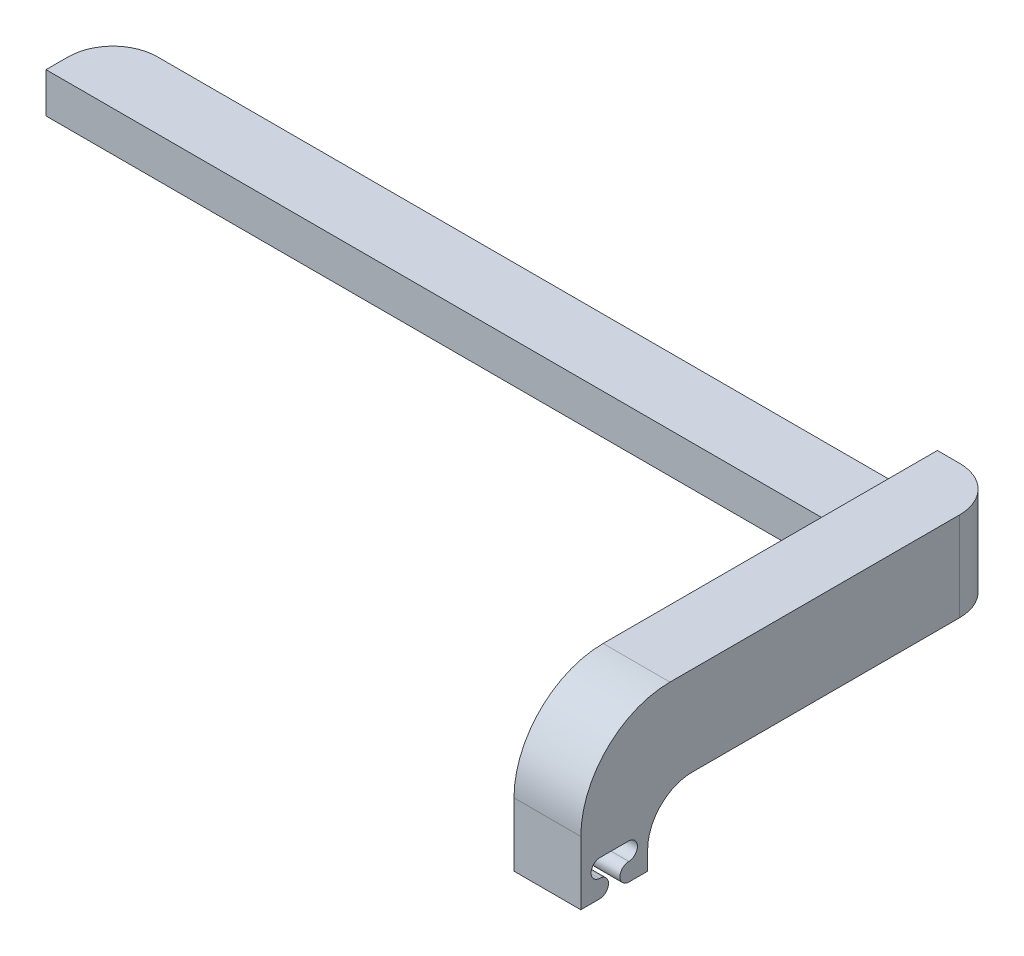
ISO-10303-21;
HEADER;
FILE_DESCRIPTION(('STEP AP214'),'2;1');
FILE_NAME('part.step','',(''),(''),'','','');
FILE_SCHEMA(('AUTOMOTIVE_DESIGN { 1 0 10303 214 1 1 1 1 }'));
ENDSEC;
DATA;
#1=APPLICATION_CONTEXT('core data for automotive mechanical design processes');
#2=APPLICATION_PROTOCOL_DEFINITION('international standard','automotive_design',2000,#1);
#3=PRODUCT_CONTEXT('',#1,'mechanical');
#4=PRODUCT('Part','Part','',(#3));
#5=PRODUCT_RELATED_PRODUCT_CATEGORY('part','',(#4));
#6=PRODUCT_DEFINITION_FORMATION('','',#4);
#7=PRODUCT_DEFINITION_CONTEXT('part definition',#1,'design');
#8=PRODUCT_DEFINITION('design','',#6,#7);
#9=PRODUCT_DEFINITION_SHAPE('','',#8);
#10=(LENGTH_UNIT() NAMED_UNIT(*) SI_UNIT(.MILLI.,.METRE.));
#11=(NAMED_UNIT(*) PLANE_ANGLE_UNIT() SI_UNIT($,.RADIAN.));
#12=(NAMED_UNIT(*) SI_UNIT($,.STERADIAN.) SOLID_ANGLE_UNIT());
#13=UNCERTAINTY_MEASURE_WITH_UNIT(LENGTH_MEASURE(1.E-05),#10,'distance_accuracy_value','');
#14=(GEOMETRIC_REPRESENTATION_CONTEXT(3) GLOBAL_UNCERTAINTY_ASSIGNED_CONTEXT((#13)) GLOBAL_UNIT_ASSIGNED_CONTEXT((#10,
#11,#12)) REPRESENTATION_CONTEXT('',''));
#15=CARTESIAN_POINT('',(0.,0.,0.));
#16=DIRECTION('',(0.,0.,1.));
#17=DIRECTION('',(1.,0.,0.));
#18=AXIS2_PLACEMENT_3D('',#15,#16,#17);
#19=CARTESIAN_POINT('',(-43.083100559231,-15.6274777520744,-31.25));
#20=DIRECTION('',(0.,1.,0.));
#21=DIRECTION('',(0.,0.,1.));
#22=AXIS2_PLACEMENT_3D('',#19,#20,#21);
#23=CYLINDRICAL_SURFACE('',#22,5.);
#24=CARTESIAN_POINT('',(-43.083100559231,-25.6274777520744,-31.25));
#25=DIRECTION('',(0.,-1.,0.));
#26=DIRECTION('',(0.,0.,-1.));
#27=AXIS2_PLACEMENT_3D('',#24,#25,#26);
#28=CIRCLE('',#27,5.);
#29=CARTESIAN_POINT('',(-48.083100559231,-25.6274777520744,-31.25));
#30=VERTEX_POINT('',#29);
#31=CARTESIAN_POINT('',(-43.083100559231,-25.6274777520744,-36.25));
#32=VERTEX_POINT('',#31);
#33=EDGE_CURVE('E347',#30,#32,#28,.T.);
#34=ORIENTED_EDGE('',*,*,#33,.F.);
#35=DIRECTION('',(0.,1.,0.));
#36=VECTOR('',#35,1.);
#37=CARTESIAN_POINT('',(-48.083100559231,-21.1274777520744,-31.25));
#38=LINE('',#37,#36);
#39=CARTESIAN_POINT('',(-48.083100559231,-21.1274777520744,-31.25));
#40=VERTEX_POINT('',#39);
#41=EDGE_CURVE('E338',#40,#30,#38,.F.);
#42=ORIENTED_EDGE('',*,*,#41,.F.);
#43=CARTESIAN_POINT('',(-43.083100559231,-21.1274777520744,-31.25));
#44=DIRECTION('',(0.,1.,0.));
#45=DIRECTION('',(0.,0.,1.));
#46=AXIS2_PLACEMENT_3D('',#43,#44,#45);
#47=CIRCLE('',#46,5.);
#48=CARTESIAN_POINT('',(-43.083100559231,-21.1274777520744,-36.25));
#49=VERTEX_POINT('',#48);
#50=EDGE_CURVE('E335',#49,#40,#47,.T.);
#51=ORIENTED_EDGE('',*,*,#50,.F.);
#52=DIRECTION('',(0.,1.,0.));
#53=VECTOR('',#52,1.);
#54=CARTESIAN_POINT('',(-43.083100559231,-15.6274777520744,-36.25));
#55=LINE('',#54,#53);
#56=EDGE_CURVE('E331',#32,#49,#55,.T.);
#57=ORIENTED_EDGE('',*,*,#56,.F.);
#58=EDGE_LOOP('',(#34,#42,#51,#57));
#59=FACE_BOUND('',#58,.T.);
#60=ADVANCED_FACE('F43',(#59),#23,.T.);
#61=CARTESIAN_POINT('',(-48.083100559231,-21.1274777520744,-28.75));
#62=DIRECTION('',(-1.,0.,0.));
#63=DIRECTION('',(0.,0.,1.));
#64=AXIS2_PLACEMENT_3D('',#61,#62,#63);
#65=PLANE('',#64);
#66=DIRECTION('',(0.,0.,-1.));
#67=VECTOR('',#66,1.);
#68=CARTESIAN_POINT('',(-48.083100559231,-21.1274777520744,-28.75));
#69=LINE('',#68,#67);
#70=CARTESIAN_POINT('',(-48.083100559231,-21.1274777520744,-28.75));
#71=VERTEX_POINT('',#70);
#72=EDGE_CURVE('E271',#71,#40,#69,.T.);
#73=ORIENTED_EDGE('',*,*,#72,.T.);
#74=ORIENTED_EDGE('',*,*,#41,.T.);
#75=DIRECTION('',(0.,0.,-1.));
#76=VECTOR('',#75,1.);
#77=CARTESIAN_POINT('',(-48.083100559231,-25.6274777520744,-28.75));
#78=LINE('',#77,#76);
#79=CARTESIAN_POINT('',(-48.083100559231,-25.6274777520744,-28.75));
#80=VERTEX_POINT('',#79);
#81=EDGE_CURVE('E263',#80,#30,#78,.T.);
#82=ORIENTED_EDGE('',*,*,#81,.F.);
#83=DIRECTION('',(0.,1.,0.));
#84=VECTOR('',#83,1.);
#85=CARTESIAN_POINT('',(-48.083100559231,-21.1274777520744,-28.75));
#86=LINE('',#85,#84);
#87=EDGE_CURVE('E255',#80,#71,#86,.T.);
#88=ORIENTED_EDGE('',*,*,#87,.T.);
#89=EDGE_LOOP('',(#73,#74,#82,#88));
#90=FACE_BOUND('',#89,.T.);
#91=ADVANCED_FACE('F411',(#90),#65,.T.);
#92=CARTESIAN_POINT('',(0.,0.,-28.75));
#93=DIRECTION('',(0.,0.,-1.));
#94=DIRECTION('',(0.,1.,0.));
#95=AXIS2_PLACEMENT_3D('',#92,#93,#94);
#96=PLANE('',#95);
#97=DIRECTION('',(0.,-1.,0.));
#98=VECTOR('',#97,1.);
#99=CARTESIAN_POINT('',(44.416899440769,-21.1274777520744,-28.75));
#100=LINE('',#99,#98);
#101=CARTESIAN_POINT('',(44.416899440769,-21.1274777520744,-28.75));
#102=VERTEX_POINT('',#101);
#103=CARTESIAN_POINT('',(44.416899440769,-25.6274777520744,-28.75));
#104=VERTEX_POINT('',#103);
#105=EDGE_CURVE('E247',#102,#104,#100,.T.);
#106=ORIENTED_EDGE('',*,*,#105,.F.);
#107=DIRECTION('',(1.,0.,0.));
#108=VECTOR('',#107,1.);
#109=CARTESIAN_POINT('',(44.416899440769,-21.1274777520744,-28.75));
#110=LINE('',#109,#108);
#111=EDGE_CURVE('E259',#71,#102,#110,.T.);
#112=ORIENTED_EDGE('',*,*,#111,.F.);
#113=ORIENTED_EDGE('',*,*,#87,.F.);
#114=DIRECTION('',(-1.,0.,0.));
#115=VECTOR('',#114,1.);
#116=CARTESIAN_POINT('',(44.416899440769,-25.6274777520744,-28.75));
#117=LINE('',#116,#115);
#118=EDGE_CURVE('E251',#104,#80,#117,.T.);
#119=ORIENTED_EDGE('',*,*,#118,.F.);
#120=EDGE_LOOP('',(#106,#112,#113,#119));
#121=FACE_BOUND('',#120,.T.);
#122=ADVANCED_FACE('F417',(#121),#96,.F.);
#123=CARTESIAN_POINT('',(44.416899440769,-21.1274777520744,-28.75));
#124=DIRECTION('',(0.,1.,0.));
#125=DIRECTION('',(0.,0.,1.));
#126=AXIS2_PLACEMENT_3D('',#123,#124,#125);
#127=PLANE('',#126);
#128=DIRECTION('',(1.,0.,0.));
#129=VECTOR('',#128,1.);
#130=CARTESIAN_POINT('',(44.416899440769,-21.1274777520744,-36.25));
#131=LINE('',#130,#129);
#132=CARTESIAN_POINT('',(44.416899440769,-21.1274777520744,-36.25));
#133=VERTEX_POINT('',#132);
#134=EDGE_CURVE('E246',#49,#133,#131,.T.);
#135=ORIENTED_EDGE('',*,*,#134,.F.);
#136=ORIENTED_EDGE('',*,*,#50,.T.);
#137=ORIENTED_EDGE('',*,*,#72,.F.);
#138=ORIENTED_EDGE('',*,*,#111,.T.);
#139=DIRECTION('',(0.,0.,-1.));
#140=VECTOR('',#139,1.);
#141=CARTESIAN_POINT('',(44.416899440769,-21.1274777520744,-28.75));
#142=LINE('',#141,#140);
#143=EDGE_CURVE('E266',#102,#133,#142,.T.);
#144=ORIENTED_EDGE('',*,*,#143,.T.);
#145=EDGE_LOOP('',(#135,#136,#137,#138,#144));
#146=FACE_BOUND('',#145,.T.);
#147=ADVANCED_FACE('F461',(#146),#127,.T.);
#148=CARTESIAN_POINT('',(44.416899440769,-15.6274777520744,-36.25));
#149=DIRECTION('',(0.,0.,-1.));
#150=DIRECTION('',(0.,1.,0.));
#151=AXIS2_PLACEMENT_3D('',#148,#149,#150);
#152=PLANE('',#151);
#153=DIRECTION('',(1.,0.,0.));
#154=VECTOR('',#153,1.);
#155=CARTESIAN_POINT('',(44.416899440769,-25.6274777520744,-36.25));
#156=LINE('',#155,#154);
#157=CARTESIAN_POINT('',(46.916899440769,-25.6274777520744,-36.25));
#158=VERTEX_POINT('',#157);
#159=EDGE_CURVE('E285',#32,#158,#156,.T.);
#160=ORIENTED_EDGE('',*,*,#159,.F.);
#161=ORIENTED_EDGE('',*,*,#56,.T.);
#162=ORIENTED_EDGE('',*,*,#134,.T.);
#163=DIRECTION('',(0.,1.,0.));
#164=VECTOR('',#163,1.);
#165=CARTESIAN_POINT('',(44.416899440769,-15.6274777520744,-36.25));
#166=LINE('',#165,#164);
#167=CARTESIAN_POINT('',(44.416899440769,-15.6274777520744,-36.25));
#168=VERTEX_POINT('',#167);
#169=EDGE_CURVE('E281',#133,#168,#166,.T.);
#170=ORIENTED_EDGE('',*,*,#169,.T.);
#171=DIRECTION('',(1.,0.,0.));
#172=VECTOR('',#171,1.);
#173=CARTESIAN_POINT('',(44.416899440769,-15.6274777520744,-36.25));
#174=LINE('',#173,#172);
#175=CARTESIAN_POINT('',(46.916899440769,-15.6274777520744,-36.25));
#176=VERTEX_POINT('',#175);
#177=EDGE_CURVE('E289',#168,#176,#174,.T.);
#178=ORIENTED_EDGE('',*,*,#177,.T.);
#179=DIRECTION('',(0.,1.,0.));
#180=VECTOR('',#179,1.);
#181=CARTESIAN_POINT('',(46.916899440769,-25.6274777520744,-36.25));
#182=LINE('',#181,#180);
#183=EDGE_CURVE('E328',#176,#158,#182,.F.);
#184=ORIENTED_EDGE('',*,*,#183,.T.);
#185=EDGE_LOOP('',(#160,#161,#162,#170,#178,#184));
#186=FACE_BOUND('',#185,.T.);
#187=ADVANCED_FACE('F435',(#186),#152,.T.);
#188=CARTESIAN_POINT('',(0.,-15.6274777520744,11.25));
#189=DIRECTION('',(0.,-1.,0.));
#190=DIRECTION('',(1.,0.,0.));
#191=AXIS2_PLACEMENT_3D('',#188,#189,#190);
#192=PLANE('',#191);
#193=DIRECTION('',(0.,0.,-1.));
#194=VECTOR('',#193,1.);
#195=CARTESIAN_POINT('',(51.916899440769,-15.6274777520745,11.25));
#196=LINE('',#195,#194);
#197=CARTESIAN_POINT('',(51.916899440769,-15.6274777520745,1.25));
#198=VERTEX_POINT('',#197);
#199=CARTESIAN_POINT('',(51.916899440769,-15.6274777520745,-31.25));
#200=VERTEX_POINT('',#199);
#201=EDGE_CURVE('E310',#198,#200,#196,.T.);
#202=ORIENTED_EDGE('',*,*,#201,.T.);
#203=CARTESIAN_POINT('',(46.916899440769,-15.6274777520744,-31.25));
#204=DIRECTION('',(0.,-1.,0.));
#205=DIRECTION('',(1.,0.,0.));
#206=AXIS2_PLACEMENT_3D('',#203,#204,#205);
#207=CIRCLE('',#206,5.);
#208=EDGE_CURVE('E354',#200,#176,#207,.F.);
#209=ORIENTED_EDGE('',*,*,#208,.T.);
#210=ORIENTED_EDGE('',*,*,#177,.F.);
#211=DIRECTION('',(0.,0.,-1.));
#212=VECTOR('',#211,1.);
#213=CARTESIAN_POINT('',(44.416899440769,-15.6274777520744,11.25));
#214=LINE('',#213,#212);
#215=CARTESIAN_POINT('',(44.416899440769,-15.6274777520744,1.25));
#216=VERTEX_POINT('',#215);
#217=EDGE_CURVE('E303',#216,#168,#214,.T.);
#218=ORIENTED_EDGE('',*,*,#217,.F.);
#219=DIRECTION('',(-1.,0.,0.));
#220=VECTOR('',#219,1.);
#221=CARTESIAN_POINT('',(51.916899440769,-15.6274777520745,1.25));
#222=LINE('',#221,#220);
#223=EDGE_CURVE('E321',#216,#198,#222,.F.);
#224=ORIENTED_EDGE('',*,*,#223,.T.);
#225=EDGE_LOOP('',(#202,#209,#210,#218,#224));
#226=FACE_BOUND('',#225,.T.);
#227=ADVANCED_FACE('F427',(#226),#192,.F.);
#228=CARTESIAN_POINT('',(46.916899440769,0.,-31.25));
#229=DIRECTION('',(0.,-1.,0.));
#230=DIRECTION('',(0.,0.,-1.));
#231=AXIS2_PLACEMENT_3D('',#228,#229,#230);
#232=CYLINDRICAL_SURFACE('',#231,5.);
#233=CARTESIAN_POINT('',(46.916899440769,-25.6274777520744,-31.25));
#234=DIRECTION('',(0.,-1.,0.));
#235=DIRECTION('',(0.,0.,-1.));
#236=AXIS2_PLACEMENT_3D('',#233,#234,#235);
#237=CIRCLE('',#236,5.);
#238=CARTESIAN_POINT('',(51.916899440769,-25.6274777520744,-31.25));
#239=VERTEX_POINT('',#238);
#240=EDGE_CURVE('E344',#158,#239,#237,.T.);
#241=ORIENTED_EDGE('',*,*,#240,.F.);
#242=ORIENTED_EDGE('',*,*,#183,.F.);
#243=ORIENTED_EDGE('',*,*,#208,.F.);
#244=DIRECTION('',(0.,1.,0.));
#245=VECTOR('',#244,1.);
#246=CARTESIAN_POINT('',(51.916899440769,-15.6274777520744,-31.25));
#247=LINE('',#246,#245);
#248=EDGE_CURVE('E350',#239,#200,#247,.T.);
#249=ORIENTED_EDGE('',*,*,#248,.F.);
#250=EDGE_LOOP('',(#241,#242,#243,#249));
#251=FACE_BOUND('',#250,.T.);
#252=ADVANCED_FACE('F424',(#251),#232,.T.);
#253=CARTESIAN_POINT('',(44.416899440769,-25.6274777520744,3.75));
#254=DIRECTION('',(0.,-1.,0.));
#255=DIRECTION('',(0.,0.,-1.));
#256=AXIS2_PLACEMENT_3D('',#253,#254,#255);
#257=PLANE('',#256);
#258=ORIENTED_EDGE('',*,*,#81,.T.);
#259=ORIENTED_EDGE('',*,*,#33,.T.);
#260=ORIENTED_EDGE('',*,*,#159,.T.);
#261=ORIENTED_EDGE('',*,*,#240,.T.);
#262=DIRECTION('',(0.,0.,-1.));
#263=VECTOR('',#262,1.);
#264=CARTESIAN_POINT('',(51.916899440769,-25.6274777520744,3.75));
#265=LINE('',#264,#263);
#266=CARTESIAN_POINT('',(51.916899440769,-25.6274777520744,-1.25));
#267=VERTEX_POINT('',#266);
#268=EDGE_CURVE('E270',#267,#239,#265,.T.);
#269=ORIENTED_EDGE('',*,*,#268,.F.);
#270=DIRECTION('',(1.,0.,0.));
#271=VECTOR('',#270,1.);
#272=CARTESIAN_POINT('',(44.416899440769,-25.6274777520744,-1.25));
#273=LINE('',#272,#271);
#274=CARTESIAN_POINT('',(44.416899440769,-25.6274777520744,-1.25));
#275=VERTEX_POINT('',#274);
#276=EDGE_CURVE('E341',#267,#275,#273,.F.);
#277=ORIENTED_EDGE('',*,*,#276,.T.);
#278=DIRECTION('',(0.,0.,-1.));
#279=VECTOR('',#278,1.);
#280=CARTESIAN_POINT('',(44.416899440769,-25.6274777520744,3.75));
#281=LINE('',#280,#279);
#282=EDGE_CURVE('E278',#275,#104,#281,.T.);
#283=ORIENTED_EDGE('',*,*,#282,.T.);
#284=ORIENTED_EDGE('',*,*,#118,.T.);
#285=EDGE_LOOP('',(#258,#259,#260,#261,#269,#277,#283,#284));
#286=FACE_BOUND('',#285,.T.);
#287=ADVANCED_FACE('F426',(#286),#257,.T.);
#288=CARTESIAN_POINT('',(0.,-25.6274777520744,1.25));
#289=DIRECTION('',(1.,0.,0.));
#290=DIRECTION('',(0.,1.,0.));
#291=AXIS2_PLACEMENT_3D('',#288,#289,#290);
#292=CYLINDRICAL_SURFACE('',#291,10.);
#293=CARTESIAN_POINT('',(51.916899440769,-25.6274777520745,1.25));
#294=DIRECTION('',(-1.,0.,0.));
#295=DIRECTION('',(0.,0.,1.));
#296=AXIS2_PLACEMENT_3D('',#293,#294,#295);
#297=CIRCLE('',#296,10.);
#298=CARTESIAN_POINT('',(51.916899440769,-25.6274777520745,11.25));
#299=VERTEX_POINT('',#298);
#300=EDGE_CURVE('E324',#198,#299,#297,.F.);
#301=ORIENTED_EDGE('',*,*,#300,.F.);
#302=ORIENTED_EDGE('',*,*,#223,.F.);
#303=CARTESIAN_POINT('',(44.416899440769,-25.6274777520744,1.25));
#304=DIRECTION('',(-1.,0.,0.));
#305=DIRECTION('',(0.,-1.,0.));
#306=AXIS2_PLACEMENT_3D('',#303,#304,#305);
#307=CIRCLE('',#306,10.);
#308=CARTESIAN_POINT('',(44.416899440769,-25.6274777520744,11.25));
#309=VERTEX_POINT('',#308);
#310=EDGE_CURVE('E318',#309,#216,#307,.T.);
#311=ORIENTED_EDGE('',*,*,#310,.F.);
#312=DIRECTION('',(-1.,0.,0.));
#313=VECTOR('',#312,1.);
#314=CARTESIAN_POINT('',(44.4168994407689,-25.6274777520744,11.25));
#315=LINE('',#314,#313);
#316=EDGE_CURVE('E314',#299,#309,#315,.T.);
#317=ORIENTED_EDGE('',*,*,#316,.F.);
#318=EDGE_LOOP('',(#301,#302,#311,#317));
#319=FACE_BOUND('',#318,.T.);
#320=ADVANCED_FACE('F422',(#319),#292,.T.);
#321=CARTESIAN_POINT('',(0.,-30.6274777520744,-1.25));
#322=DIRECTION('',(1.,0.,0.));
#323=DIRECTION('',(0.,0.,-1.));
#324=AXIS2_PLACEMENT_3D('',#321,#322,#323);
#325=CYLINDRICAL_SURFACE('',#324,5.);
#326=CARTESIAN_POINT('',(44.416899440769,-30.6274777520744,-1.25));
#327=DIRECTION('',(-1.,0.,0.));
#328=DIRECTION('',(0.,-1.,0.));
#329=AXIS2_PLACEMENT_3D('',#326,#327,#328);
#330=CIRCLE('',#329,5.);
#331=CARTESIAN_POINT('',(44.416899440769,-30.6274777520744,3.75));
#332=VERTEX_POINT('',#331);
#333=EDGE_CURVE('E363',#275,#332,#330,.F.);
#334=ORIENTED_EDGE('',*,*,#333,.F.);
#335=ORIENTED_EDGE('',*,*,#276,.F.);
#336=CARTESIAN_POINT('',(51.916899440769,-30.6274777520744,-1.25));
#337=DIRECTION('',(-1.,0.,0.));
#338=DIRECTION('',(0.,0.,1.));
#339=AXIS2_PLACEMENT_3D('',#336,#337,#338);
#340=CIRCLE('',#339,5.);
#341=CARTESIAN_POINT('',(51.916899440769,-30.6274777520744,3.75));
#342=VERTEX_POINT('',#341);
#343=EDGE_CURVE('E360',#342,#267,#340,.T.);
#344=ORIENTED_EDGE('',*,*,#343,.F.);
#345=DIRECTION('',(1.,0.,0.));
#346=VECTOR('',#345,1.);
#347=CARTESIAN_POINT('',(0.,-30.6274777520744,3.75));
#348=LINE('',#347,#346);
#349=EDGE_CURVE('E357',#332,#342,#348,.T.);
#350=ORIENTED_EDGE('',*,*,#349,.F.);
#351=EDGE_LOOP('',(#334,#335,#344,#350));
#352=FACE_BOUND('',#351,.T.);
#353=ADVANCED_FACE('F45',(#352),#325,.F.);
#354=CARTESIAN_POINT('',(0.,0.,11.25));
#355=DIRECTION('',(0.,0.,1.));
#356=DIRECTION('',(1.,0.,0.));
#357=AXIS2_PLACEMENT_3D('',#354,#355,#356);
#358=PLANE('',#357);
#359=DIRECTION('',(0.,1.,0.));
#360=VECTOR('',#359,1.);
#361=CARTESIAN_POINT('',(44.4168994407689,0.,11.25));
#362=LINE('',#361,#360);
#363=CARTESIAN_POINT('',(44.416899440769,-32.7524777520744,11.25));
#364=VERTEX_POINT('',#363);
#365=EDGE_CURVE('E296',#364,#309,#362,.T.);
#366=ORIENTED_EDGE('',*,*,#365,.F.);
#367=DIRECTION('',(-1.,0.,0.));
#368=VECTOR('',#367,1.);
#369=CARTESIAN_POINT('',(54.416899440769,-32.7524777520744,11.25));
#370=LINE('',#369,#368);
#371=CARTESIAN_POINT('',(51.916899440769,-32.7524777520744,11.25));
#372=VERTEX_POINT('',#371);
#373=EDGE_CURVE('E223',#372,#364,#370,.T.);
#374=ORIENTED_EDGE('',*,*,#373,.F.);
#375=DIRECTION('',(0.,1.,0.));
#376=VECTOR('',#375,1.);
#377=CARTESIAN_POINT('',(51.916899440769,0.,11.25));
#378=LINE('',#377,#376);
#379=EDGE_CURVE('E299',#372,#299,#378,.T.);
#380=ORIENTED_EDGE('',*,*,#379,.T.);
#381=ORIENTED_EDGE('',*,*,#316,.T.);
#382=EDGE_LOOP('',(#366,#374,#380,#381));
#383=FACE_BOUND('',#382,.T.);
#384=ADVANCED_FACE('F454',(#383),#358,.T.);
#385=CARTESIAN_POINT('',(0.,0.,3.75));
#386=DIRECTION('',(0.,0.,1.));
#387=DIRECTION('',(1.,0.,0.));
#388=AXIS2_PLACEMENT_3D('',#385,#386,#387);
#389=PLANE('',#388);
#390=DIRECTION('',(0.,1.,0.));
#391=VECTOR('',#390,1.);
#392=CARTESIAN_POINT('',(51.916899440769,0.,3.75));
#393=LINE('',#392,#391);
#394=CARTESIAN_POINT('',(51.916899440769,-32.7524777520744,3.75));
#395=VERTEX_POINT('',#394);
#396=EDGE_CURVE('E300',#395,#342,#393,.T.);
#397=ORIENTED_EDGE('',*,*,#396,.F.);
#398=DIRECTION('',(-1.,0.,0.));
#399=VECTOR('',#398,1.);
#400=CARTESIAN_POINT('',(54.416899440769,-32.7524777520744,3.75));
#401=LINE('',#400,#399);
#402=CARTESIAN_POINT('',(44.416899440769,-32.7524777520744,3.75));
#403=VERTEX_POINT('',#402);
#404=EDGE_CURVE('E226',#395,#403,#401,.T.);
#405=ORIENTED_EDGE('',*,*,#404,.T.);
#406=DIRECTION('',(0.,1.,0.));
#407=VECTOR('',#406,1.);
#408=CARTESIAN_POINT('',(44.4168994407689,0.,3.75));
#409=LINE('',#408,#407);
#410=EDGE_CURVE('E66',#403,#332,#409,.T.);
#411=ORIENTED_EDGE('',*,*,#410,.T.);
#412=ORIENTED_EDGE('',*,*,#349,.T.);
#413=EDGE_LOOP('',(#397,#405,#411,#412));
#414=FACE_BOUND('',#413,.T.);
#415=ADVANCED_FACE('F398',(#414),#389,.F.);
#416=CARTESIAN_POINT('',(51.916899440769,0.,11.25));
#417=DIRECTION('',(-1.,0.,0.));
#418=DIRECTION('',(0.,0.,1.));
#419=AXIS2_PLACEMENT_3D('',#416,#417,#418);
#420=PLANE('',#419);
#421=DIRECTION('',(0.,0.,1.));
#422=VECTOR('',#421,1.);
#423=CARTESIAN_POINT('',(51.916899440769,-32.7524777520744,11.25));
#424=LINE('',#423,#422);
#425=CARTESIAN_POINT('',(51.916899440769,-32.7524777520744,9.14154578551342));
#426=VERTEX_POINT('',#425);
#427=EDGE_CURVE('E243',#426,#372,#424,.T.);
#428=ORIENTED_EDGE('',*,*,#427,.F.);
#429=CARTESIAN_POINT('',(51.916899440769,-31.7524777520744,9.14154578551342));
#430=DIRECTION('',(-1.,0.,0.));
#431=DIRECTION('',(0.,0.,1.));
#432=AXIS2_PLACEMENT_3D('',#429,#430,#431);
#433=CIRCLE('',#432,1.);
#434=CARTESIAN_POINT('',(51.916899440769,-30.7524777520744,9.14154578551342));
#435=VERTEX_POINT('',#434);
#436=EDGE_CURVE('E11',#426,#435,#433,.F.);
#437=ORIENTED_EDGE('',*,*,#436,.T.);
#438=CARTESIAN_POINT('',(51.916899440769,-29.7524777520744,9.09725259773677));
#439=DIRECTION('',(-1.,0.,0.));
#440=DIRECTION('',(0.,0.,1.));
#441=AXIS2_PLACEMENT_3D('',#438,#439,#440);
#442=CIRCLE('',#441,1.00098046258827);
#443=CARTESIAN_POINT('',(51.916899440769,-28.7524777520744,9.14154578551342));
#444=VERTEX_POINT('',#443);
#445=EDGE_CURVE('E184',#435,#444,#442,.T.);
#446=ORIENTED_EDGE('',*,*,#445,.T.);
#447=DIRECTION('',(0.,0.,1.));
#448=VECTOR('',#447,1.);
#449=CARTESIAN_POINT('',(51.916899440769,-28.7524777520744,11.25));
#450=LINE('',#449,#448);
#451=CARTESIAN_POINT('',(51.916899440769,-28.7524777520744,5.85845421448658));
#452=VERTEX_POINT('',#451);
#453=EDGE_CURVE('E368',#452,#444,#450,.T.);
#454=ORIENTED_EDGE('',*,*,#453,.F.);
#455=CARTESIAN_POINT('',(51.916899440769,-29.7524777520744,5.90274740226323));
#456=DIRECTION('',(-1.,0.,0.));
#457=DIRECTION('',(0.,0.,1.));
#458=AXIS2_PLACEMENT_3D('',#455,#456,#457);
#459=CIRCLE('',#458,1.00098046258827);
#460=CARTESIAN_POINT('',(51.916899440769,-30.7524777520744,5.85845421448658));
#461=VERTEX_POINT('',#460);
#462=EDGE_CURVE('E371',#461,#452,#459,.F.);
#463=ORIENTED_EDGE('',*,*,#462,.F.);
#464=CARTESIAN_POINT('',(51.916899440769,-31.7524777520744,5.85845421448658));
#465=DIRECTION('',(-1.,0.,0.));
#466=DIRECTION('',(0.,0.,1.));
#467=AXIS2_PLACEMENT_3D('',#464,#465,#466);
#468=CIRCLE('',#467,1.);
#469=CARTESIAN_POINT('',(51.916899440769,-32.7524777520744,5.85845421448658));
#470=VERTEX_POINT('',#469);
#471=EDGE_CURVE('E52',#470,#461,#468,.T.);
#472=ORIENTED_EDGE('',*,*,#471,.F.);
#473=DIRECTION('',(0.,0.,-1.));
#474=VECTOR('',#473,1.);
#475=CARTESIAN_POINT('',(51.916899440769,-32.7524777520744,11.25));
#476=LINE('',#475,#474);
#477=EDGE_CURVE('E222',#470,#395,#476,.T.);
#478=ORIENTED_EDGE('',*,*,#477,.T.);
#479=ORIENTED_EDGE('',*,*,#396,.T.);
#480=ORIENTED_EDGE('',*,*,#343,.T.);
#481=ORIENTED_EDGE('',*,*,#268,.T.);
#482=ORIENTED_EDGE('',*,*,#248,.T.);
#483=ORIENTED_EDGE('',*,*,#201,.F.);
#484=ORIENTED_EDGE('',*,*,#300,.T.);
#485=ORIENTED_EDGE('',*,*,#379,.F.);
#486=EDGE_LOOP('',(#428,#437,#446,#454,#463,#472,#478,#479,#480,#481,#482,#483,#484,#485));
#487=FACE_BOUND('',#486,.T.);
#488=ADVANCED_FACE('F388',(#487),#420,.F.);
#489=CARTESIAN_POINT('',(44.4168994407689,0.,11.25));
#490=DIRECTION('',(-1.,0.,0.));
#491=DIRECTION('',(0.,-1.,0.));
#492=AXIS2_PLACEMENT_3D('',#489,#490,#491);
#493=PLANE('',#492);
#494=CARTESIAN_POINT('',(44.416899440769,-31.7524777520744,9.14154578551342));
#495=DIRECTION('',(-1.,0.,0.));
#496=DIRECTION('',(0.,-1.,0.));
#497=AXIS2_PLACEMENT_3D('',#494,#495,#496);
#498=CIRCLE('',#497,1.);
#499=CARTESIAN_POINT('',(44.416899440769,-32.7524777520744,9.14154578551342));
#500=VERTEX_POINT('',#499);
#501=CARTESIAN_POINT('',(44.416899440769,-30.7524777520744,9.14154578551342));
#502=VERTEX_POINT('',#501);
#503=EDGE_CURVE('E191',#500,#502,#498,.F.);
#504=ORIENTED_EDGE('',*,*,#503,.F.);
#505=DIRECTION('',(0.,0.,1.));
#506=VECTOR('',#505,1.);
#507=CARTESIAN_POINT('',(44.416899440769,-32.7524777520744,0.));
#508=LINE('',#507,#506);
#509=EDGE_CURVE('E188',#500,#364,#508,.T.);
#510=ORIENTED_EDGE('',*,*,#509,.T.);
#511=ORIENTED_EDGE('',*,*,#365,.T.);
#512=ORIENTED_EDGE('',*,*,#310,.T.);
#513=ORIENTED_EDGE('',*,*,#217,.T.);
#514=ORIENTED_EDGE('',*,*,#169,.F.);
#515=ORIENTED_EDGE('',*,*,#143,.F.);
#516=ORIENTED_EDGE('',*,*,#105,.T.);
#517=ORIENTED_EDGE('',*,*,#282,.F.);
#518=ORIENTED_EDGE('',*,*,#333,.T.);
#519=ORIENTED_EDGE('',*,*,#410,.F.);
#520=DIRECTION('',(0.,0.,-1.));
#521=VECTOR('',#520,1.);
#522=CARTESIAN_POINT('',(44.416899440769,-32.7524777520744,0.));
#523=LINE('',#522,#521);
#524=CARTESIAN_POINT('',(44.416899440769,-32.7524777520744,5.85845421448658));
#525=VERTEX_POINT('',#524);
#526=EDGE_CURVE('E59',#525,#403,#523,.T.);
#527=ORIENTED_EDGE('',*,*,#526,.F.);
#528=CARTESIAN_POINT('',(44.416899440769,-31.7524777520744,5.85845421448658));
#529=DIRECTION('',(-1.,0.,0.));
#530=DIRECTION('',(0.,-1.,0.));
#531=AXIS2_PLACEMENT_3D('',#528,#529,#530);
#532=CIRCLE('',#531,1.);
#533=CARTESIAN_POINT('',(44.416899440769,-30.7524777520744,5.85845421448658));
#534=VERTEX_POINT('',#533);
#535=EDGE_CURVE('E212',#525,#534,#532,.T.);
#536=ORIENTED_EDGE('',*,*,#535,.T.);
#537=CARTESIAN_POINT('',(44.416899440769,-29.7524777520744,5.90274740226323));
#538=DIRECTION('',(-1.,0.,0.));
#539=DIRECTION('',(0.,-1.,0.));
#540=AXIS2_PLACEMENT_3D('',#537,#538,#539);
#541=CIRCLE('',#540,1.00098046258827);
#542=CARTESIAN_POINT('',(44.416899440769,-28.7524777520744,5.85845421448658));
#543=VERTEX_POINT('',#542);
#544=EDGE_CURVE('E207',#534,#543,#541,.F.);
#545=ORIENTED_EDGE('',*,*,#544,.T.);
#546=DIRECTION('',(0.,0.,1.));
#547=VECTOR('',#546,1.);
#548=CARTESIAN_POINT('',(44.416899440769,-28.7524777520744,0.));
#549=LINE('',#548,#547);
#550=CARTESIAN_POINT('',(44.416899440769,-28.7524777520744,9.14154578551342));
#551=VERTEX_POINT('',#550);
#552=EDGE_CURVE('E203',#543,#551,#549,.T.);
#553=ORIENTED_EDGE('',*,*,#552,.T.);
#554=CARTESIAN_POINT('',(44.416899440769,-29.7524777520744,9.09725259773677));
#555=DIRECTION('',(-1.,0.,0.));
#556=DIRECTION('',(0.,-1.,0.));
#557=AXIS2_PLACEMENT_3D('',#554,#555,#556);
#558=CIRCLE('',#557,1.00098046258827);
#559=EDGE_CURVE('E181',#502,#551,#558,.T.);
#560=ORIENTED_EDGE('',*,*,#559,.F.);
#561=EDGE_LOOP('',(#504,#510,#511,#512,#513,#514,#515,#516,#517,#518,#519,#527,#536,#545,#553,#560));
#562=FACE_BOUND('',#561,.T.);
#563=ADVANCED_FACE('F200',(#562),#493,.T.);
#564=CARTESIAN_POINT('',(54.416899440769,-31.7524777520744,9.14154578551342));
#565=DIRECTION('',(-1.,0.,0.));
#566=DIRECTION('',(0.,-1.,0.));
#567=AXIS2_PLACEMENT_3D('',#564,#565,#566);
#568=CYLINDRICAL_SURFACE('',#567,1.);
#569=DIRECTION('',(-1.,0.,0.));
#570=VECTOR('',#569,1.);
#571=CARTESIAN_POINT('',(54.416899440769,-32.7524777520744,9.14154578551342));
#572=LINE('',#571,#570);
#573=EDGE_CURVE('E194',#426,#500,#572,.T.);
#574=ORIENTED_EDGE('',*,*,#573,.T.);
#575=ORIENTED_EDGE('',*,*,#503,.T.);
#576=DIRECTION('',(-1.,0.,0.));
#577=VECTOR('',#576,1.);
#578=CARTESIAN_POINT('',(54.416899440769,-30.7524777520744,9.14154578551342));
#579=LINE('',#578,#577);
#580=EDGE_CURVE('E176',#435,#502,#579,.T.);
#581=ORIENTED_EDGE('',*,*,#580,.F.);
#582=ORIENTED_EDGE('',*,*,#436,.F.);
#583=EDGE_LOOP('',(#574,#575,#581,#582));
#584=FACE_BOUND('',#583,.T.);
#585=ADVANCED_FACE('F192',(#584),#568,.T.);
#586=CARTESIAN_POINT('',(54.416899440769,-31.7524777520744,5.85845421448658));
#587=DIRECTION('',(-1.,0.,0.));
#588=DIRECTION('',(0.,-1.,0.));
#589=AXIS2_PLACEMENT_3D('',#586,#587,#588);
#590=CYLINDRICAL_SURFACE('',#589,1.);
#591=ORIENTED_EDGE('',*,*,#471,.T.);
#592=DIRECTION('',(-1.,0.,0.));
#593=VECTOR('',#592,1.);
#594=CARTESIAN_POINT('',(54.416899440769,-30.7524777520744,5.85845421448658));
#595=LINE('',#594,#593);
#596=EDGE_CURVE('E232',#461,#534,#595,.T.);
#597=ORIENTED_EDGE('',*,*,#596,.T.);
#598=ORIENTED_EDGE('',*,*,#535,.F.);
#599=DIRECTION('',(-1.,0.,0.));
#600=VECTOR('',#599,1.);
#601=CARTESIAN_POINT('',(54.416899440769,-32.7524777520744,5.85845421448658));
#602=LINE('',#601,#600);
#603=EDGE_CURVE('E229',#470,#525,#602,.T.);
#604=ORIENTED_EDGE('',*,*,#603,.F.);
#605=EDGE_LOOP('',(#591,#597,#598,#604));
#606=FACE_BOUND('',#605,.T.);
#607=ADVANCED_FACE('F378',(#606),#590,.T.);
#608=CARTESIAN_POINT('',(54.416899440769,-29.7524777520744,5.90274740226323));
#609=DIRECTION('',(-1.,0.,0.));
#610=DIRECTION('',(0.,-1.,0.));
#611=AXIS2_PLACEMENT_3D('',#608,#609,#610);
#612=CYLINDRICAL_SURFACE('',#611,1.00098046258827);
#613=ORIENTED_EDGE('',*,*,#462,.T.);
#614=DIRECTION('',(-1.,0.,0.));
#615=VECTOR('',#614,1.);
#616=CARTESIAN_POINT('',(54.416899440769,-28.7524777520744,5.85845421448658));
#617=LINE('',#616,#615);
#618=EDGE_CURVE('E235',#452,#543,#617,.T.);
#619=ORIENTED_EDGE('',*,*,#618,.T.);
#620=ORIENTED_EDGE('',*,*,#544,.F.);
#621=ORIENTED_EDGE('',*,*,#596,.F.);
#622=EDGE_LOOP('',(#613,#619,#620,#621));
#623=FACE_BOUND('',#622,.T.);
#624=ADVANCED_FACE('F384',(#623),#612,.F.);
#625=CARTESIAN_POINT('',(54.416899440769,-28.7524777520744,0.));
#626=DIRECTION('',(0.,-1.,0.));
#627=DIRECTION('',(1.,0.,0.));
#628=AXIS2_PLACEMENT_3D('',#625,#626,#627);
#629=PLANE('',#628);
#630=ORIENTED_EDGE('',*,*,#453,.T.);
#631=DIRECTION('',(-1.,0.,0.));
#632=VECTOR('',#631,1.);
#633=CARTESIAN_POINT('',(54.416899440769,-28.7524777520744,9.14154578551342));
#634=LINE('',#633,#632);
#635=EDGE_CURVE('E187',#444,#551,#634,.T.);
#636=ORIENTED_EDGE('',*,*,#635,.T.);
#637=ORIENTED_EDGE('',*,*,#552,.F.);
#638=ORIENTED_EDGE('',*,*,#618,.F.);
#639=EDGE_LOOP('',(#630,#636,#637,#638));
#640=FACE_BOUND('',#639,.T.);
#641=ADVANCED_FACE('F390',(#640),#629,.T.);
#642=CARTESIAN_POINT('',(54.416899440769,-29.7524777520744,9.09725259773677));
#643=DIRECTION('',(-1.,0.,0.));
#644=DIRECTION('',(0.,-1.,0.));
#645=AXIS2_PLACEMENT_3D('',#642,#643,#644);
#646=CYLINDRICAL_SURFACE('',#645,1.00098046258827);
#647=ORIENTED_EDGE('',*,*,#580,.T.);
#648=ORIENTED_EDGE('',*,*,#559,.T.);
#649=ORIENTED_EDGE('',*,*,#635,.F.);
#650=ORIENTED_EDGE('',*,*,#445,.F.);
#651=EDGE_LOOP('',(#647,#648,#649,#650));
#652=FACE_BOUND('',#651,.T.);
#653=ADVANCED_FACE('F178',(#652),#646,.F.);
#654=CARTESIAN_POINT('',(54.416899440769,-32.7524777520744,0.));
#655=DIRECTION('',(0.,-1.,0.));
#656=DIRECTION('',(1.,0.,0.));
#657=AXIS2_PLACEMENT_3D('',#654,#655,#656);
#658=PLANE('',#657);
#659=ORIENTED_EDGE('',*,*,#427,.T.);
#660=ORIENTED_EDGE('',*,*,#373,.T.);
#661=ORIENTED_EDGE('',*,*,#509,.F.);
#662=ORIENTED_EDGE('',*,*,#573,.F.);
#663=EDGE_LOOP('',(#659,#660,#661,#662));
#664=FACE_BOUND('',#663,.T.);
#665=ADVANCED_FACE('F402',(#664),#658,.T.);
#666=CARTESIAN_POINT('',(54.416899440769,-32.7524777520744,0.));
#667=DIRECTION('',(0.,1.,0.));
#668=DIRECTION('',(-1.,0.,0.));
#669=AXIS2_PLACEMENT_3D('',#666,#667,#668);
#670=PLANE('',#669);
#671=ORIENTED_EDGE('',*,*,#603,.T.);
#672=ORIENTED_EDGE('',*,*,#526,.T.);
#673=ORIENTED_EDGE('',*,*,#404,.F.);
#674=ORIENTED_EDGE('',*,*,#477,.F.);
#675=EDGE_LOOP('',(#671,#672,#673,#674));
#676=FACE_BOUND('',#675,.T.);
#677=ADVANCED_FACE('F400',(#676),#670,.F.);
#678=CLOSED_SHELL('',(#60,#91,#122,#147,#187,#227,#252,#287,#320,#353,#384,#415,#488,#563,#585,
#607,#624,#641,#653,#665,#677));
#679=MANIFOLD_SOLID_BREP('B2',#678);
#680=ADVANCED_BREP_SHAPE_REPRESENTATION('',(#18,#679),#14);
#681=SHAPE_DEFINITION_REPRESENTATION(#9,#680);
ENDSEC;
END-ISO-10303-21;
